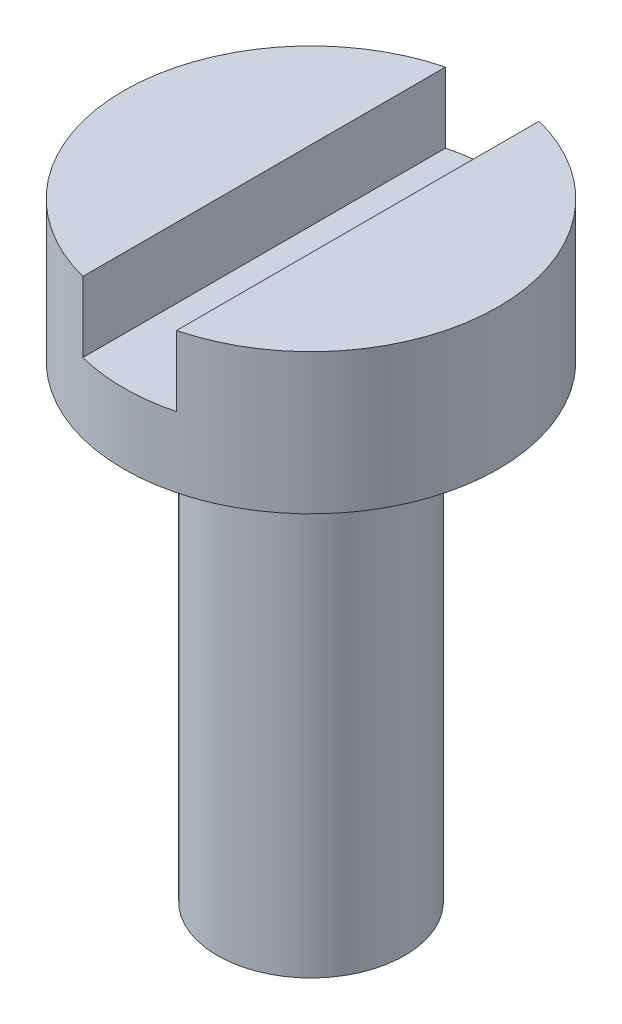
ISO-10303-21;
HEADER;
FILE_DESCRIPTION(('STEP AP214'),'2;1');
FILE_NAME('part.step','',(''),(''),'','','');
FILE_SCHEMA(('AUTOMOTIVE_DESIGN { 1 0 10303 214 1 1 1 1 }'));
ENDSEC;
DATA;
#1=APPLICATION_CONTEXT('core data for automotive mechanical design processes');
#2=APPLICATION_PROTOCOL_DEFINITION('international standard','automotive_design',2000,#1);
#3=PRODUCT_CONTEXT('',#1,'mechanical');
#4=PRODUCT('Part','Part','',(#3));
#5=PRODUCT_RELATED_PRODUCT_CATEGORY('part','',(#4));
#6=PRODUCT_DEFINITION_FORMATION('','',#4);
#7=PRODUCT_DEFINITION_CONTEXT('part definition',#1,'design');
#8=PRODUCT_DEFINITION('design','',#6,#7);
#9=PRODUCT_DEFINITION_SHAPE('','',#8);
#10=(LENGTH_UNIT() NAMED_UNIT(*) SI_UNIT(.MILLI.,.METRE.));
#11=(NAMED_UNIT(*) PLANE_ANGLE_UNIT() SI_UNIT($,.RADIAN.));
#12=(NAMED_UNIT(*) SI_UNIT($,.STERADIAN.) SOLID_ANGLE_UNIT());
#13=UNCERTAINTY_MEASURE_WITH_UNIT(LENGTH_MEASURE(1.E-05),#10,'distance_accuracy_value','');
#14=(GEOMETRIC_REPRESENTATION_CONTEXT(3) GLOBAL_UNCERTAINTY_ASSIGNED_CONTEXT((#13)) GLOBAL_UNIT_ASSIGNED_CONTEXT((#10,
#11,#12)) REPRESENTATION_CONTEXT('',''));
#15=CARTESIAN_POINT('',(0.,0.,0.));
#16=DIRECTION('',(0.,0.,1.));
#17=DIRECTION('',(1.,0.,0.));
#18=AXIS2_PLACEMENT_3D('',#15,#16,#17);
#19=CARTESIAN_POINT('',(0.,0.,0.));
#20=DIRECTION('',(0.,1.,0.));
#21=DIRECTION('',(0.,0.,1.));
#22=AXIS2_PLACEMENT_3D('',#19,#20,#21);
#23=PLANE('',#22);
#24=CARTESIAN_POINT('',(0.,0.,0.));
#25=DIRECTION('',(0.,1.,0.));
#26=DIRECTION('',(0.,0.,1.));
#27=AXIS2_PLACEMENT_3D('',#24,#25,#26);
#28=CIRCLE('',#27,4.);
#29=CARTESIAN_POINT('',(0.,0.,4.));
#30=VERTEX_POINT('',#29);
#31=EDGE_CURVE('E90',#30,#30,#28,.T.);
#32=ORIENTED_EDGE('',*,*,#31,.F.);
#33=EDGE_LOOP('',(#32));
#34=FACE_BOUND('',#33,.T.);
#35=CARTESIAN_POINT('',(0.,0.,0.));
#36=DIRECTION('',(0.,1.,0.));
#37=DIRECTION('',(0.,0.,1.));
#38=AXIS2_PLACEMENT_3D('',#35,#36,#37);
#39=CIRCLE('',#38,2.);
#40=CARTESIAN_POINT('',(0.,0.,2.));
#41=VERTEX_POINT('',#40);
#42=EDGE_CURVE('E11',#41,#41,#39,.F.);
#43=ORIENTED_EDGE('',*,*,#42,.F.);
#44=EDGE_LOOP('',(#43));
#45=FACE_BOUND('',#44,.T.);
#46=ADVANCED_FACE('F29',(#34,#45),#23,.F.);
#47=CARTESIAN_POINT('',(0.,3.,0.));
#48=DIRECTION('',(0.,1.,0.));
#49=DIRECTION('',(0.,0.,1.));
#50=AXIS2_PLACEMENT_3D('',#47,#48,#49);
#51=PLANE('',#50);
#52=DIRECTION('',(0.,0.,-1.));
#53=VECTOR('',#52,1.);
#54=CARTESIAN_POINT('',(1.,3.,0.));
#55=LINE('',#54,#53);
#56=CARTESIAN_POINT('',(1.,3.,3.87298334620742));
#57=VERTEX_POINT('',#56);
#58=CARTESIAN_POINT('',(1.,3.,-3.87298334620742));
#59=VERTEX_POINT('',#58);
#60=EDGE_CURVE('E77',#57,#59,#55,.T.);
#61=ORIENTED_EDGE('',*,*,#60,.F.);
#62=CARTESIAN_POINT('',(0.,3.,0.));
#63=DIRECTION('',(0.,1.,0.));
#64=DIRECTION('',(0.,0.,1.));
#65=AXIS2_PLACEMENT_3D('',#62,#63,#64);
#66=CIRCLE('',#65,4.);
#67=EDGE_CURVE('E78',#57,#59,#66,.T.);
#68=ORIENTED_EDGE('',*,*,#67,.T.);
#69=EDGE_LOOP('',(#61,#68));
#70=FACE_BOUND('',#69,.T.);
#71=ADVANCED_FACE('F110',(#70),#51,.T.);
#72=CARTESIAN_POINT('',(0.,3.,0.));
#73=DIRECTION('',(0.,-1.,0.));
#74=DIRECTION('',(0.,0.,-1.));
#75=AXIS2_PLACEMENT_3D('',#72,#73,#74);
#76=CYLINDRICAL_SURFACE('',#75,4.);
#77=CARTESIAN_POINT('',(0.,1.5,0.));
#78=DIRECTION('',(0.,1.,0.));
#79=DIRECTION('',(0.,0.,1.));
#80=AXIS2_PLACEMENT_3D('',#77,#78,#79);
#81=CIRCLE('',#80,4.);
#82=CARTESIAN_POINT('',(1.,1.5,-3.87298334620742));
#83=VERTEX_POINT('',#82);
#84=CARTESIAN_POINT('',(-1.,1.5,-3.87298334620742));
#85=VERTEX_POINT('',#84);
#86=EDGE_CURVE('E37',#83,#85,#81,.T.);
#87=ORIENTED_EDGE('',*,*,#86,.F.);
#88=DIRECTION('',(0.,-1.,0.));
#89=VECTOR('',#88,1.);
#90=CARTESIAN_POINT('',(1.,3.,-3.87298334620742));
#91=LINE('',#90,#89);
#92=EDGE_CURVE('E52',#83,#59,#91,.F.);
#93=ORIENTED_EDGE('',*,*,#92,.T.);
#94=ORIENTED_EDGE('',*,*,#67,.F.);
#95=DIRECTION('',(0.,-1.,0.));
#96=VECTOR('',#95,1.);
#97=CARTESIAN_POINT('',(1.,3.,3.87298334620742));
#98=LINE('',#97,#96);
#99=CARTESIAN_POINT('',(1.,1.5,3.87298334620742));
#100=VERTEX_POINT('',#99);
#101=EDGE_CURVE('E94',#57,#100,#98,.T.);
#102=ORIENTED_EDGE('',*,*,#101,.T.);
#103=CARTESIAN_POINT('',(-1.,1.5,3.87298334620742));
#104=VERTEX_POINT('',#103);
#105=EDGE_CURVE('E86',#104,#100,#81,.T.);
#106=ORIENTED_EDGE('',*,*,#105,.F.);
#107=DIRECTION('',(0.,-1.,0.));
#108=VECTOR('',#107,1.);
#109=CARTESIAN_POINT('',(-1.,3.,3.87298334620742));
#110=LINE('',#109,#108);
#111=CARTESIAN_POINT('',(-1.,3.,3.87298334620742));
#112=VERTEX_POINT('',#111);
#113=EDGE_CURVE('E72',#104,#112,#110,.F.);
#114=ORIENTED_EDGE('',*,*,#113,.T.);
#115=CARTESIAN_POINT('',(-1.,3.,-3.87298334620742));
#116=VERTEX_POINT('',#115);
#117=EDGE_CURVE('E84',#116,#112,#66,.T.);
#118=ORIENTED_EDGE('',*,*,#117,.F.);
#119=DIRECTION('',(0.,-1.,0.));
#120=VECTOR('',#119,1.);
#121=CARTESIAN_POINT('',(-1.,3.,-3.87298334620742));
#122=LINE('',#121,#120);
#123=EDGE_CURVE('E44',#116,#85,#122,.T.);
#124=ORIENTED_EDGE('',*,*,#123,.T.);
#125=EDGE_LOOP('',(#87,#93,#94,#102,#106,#114,#118,#124));
#126=FACE_BOUND('',#125,.T.);
#127=ORIENTED_EDGE('',*,*,#31,.T.);
#128=EDGE_LOOP('',(#127));
#129=FACE_BOUND('',#128,.T.);
#130=ADVANCED_FACE('F31',(#126,#129),#76,.T.);
#131=DIRECTION('',(0.,0.,1.));
#132=VECTOR('',#131,1.);
#133=CARTESIAN_POINT('',(-1.,3.,0.));
#134=LINE('',#133,#132);
#135=EDGE_CURVE('E69',#116,#112,#134,.T.);
#136=ORIENTED_EDGE('',*,*,#135,.F.);
#137=ORIENTED_EDGE('',*,*,#117,.T.);
#138=EDGE_LOOP('',(#136,#137));
#139=FACE_BOUND('',#138,.T.);
#140=ADVANCED_FACE('F89',(#139),#51,.T.);
#141=CARTESIAN_POINT('',(-1.,1.5,-5.0783360345759));
#142=DIRECTION('',(0.,1.,0.));
#143=DIRECTION('',(0.,0.,1.));
#144=AXIS2_PLACEMENT_3D('',#141,#142,#143);
#145=PLANE('',#144);
#146=ORIENTED_EDGE('',*,*,#86,.T.);
#147=DIRECTION('',(0.,0.,1.));
#148=VECTOR('',#147,1.);
#149=CARTESIAN_POINT('',(-1.,1.5,-5.0783360345759));
#150=LINE('',#149,#148);
#151=EDGE_CURVE('E100',#85,#104,#150,.T.);
#152=ORIENTED_EDGE('',*,*,#151,.T.);
#153=ORIENTED_EDGE('',*,*,#105,.T.);
#154=DIRECTION('',(0.,0.,-1.));
#155=VECTOR('',#154,1.);
#156=CARTESIAN_POINT('',(1.,1.5,4.40122456329912));
#157=LINE('',#156,#155);
#158=EDGE_CURVE('E87',#100,#83,#157,.T.);
#159=ORIENTED_EDGE('',*,*,#158,.T.);
#160=EDGE_LOOP('',(#146,#152,#153,#159));
#161=FACE_BOUND('',#160,.T.);
#162=ADVANCED_FACE('F99',(#161),#145,.T.);
#163=CARTESIAN_POINT('',(1.,1.5,4.40122456329912));
#164=DIRECTION('',(1.,0.,0.));
#165=DIRECTION('',(0.,0.,-1.));
#166=AXIS2_PLACEMENT_3D('',#163,#164,#165);
#167=PLANE('',#166);
#168=ORIENTED_EDGE('',*,*,#60,.T.);
#169=ORIENTED_EDGE('',*,*,#92,.F.);
#170=ORIENTED_EDGE('',*,*,#158,.F.);
#171=ORIENTED_EDGE('',*,*,#101,.F.);
#172=EDGE_LOOP('',(#168,#169,#170,#171));
#173=FACE_BOUND('',#172,.T.);
#174=ADVANCED_FACE('F108',(#173),#167,.F.);
#175=CARTESIAN_POINT('',(-1.,1.5,-5.0783360345759));
#176=DIRECTION('',(-1.,0.,0.));
#177=DIRECTION('',(0.,0.,1.));
#178=AXIS2_PLACEMENT_3D('',#175,#176,#177);
#179=PLANE('',#178);
#180=ORIENTED_EDGE('',*,*,#135,.T.);
#181=ORIENTED_EDGE('',*,*,#113,.F.);
#182=ORIENTED_EDGE('',*,*,#151,.F.);
#183=ORIENTED_EDGE('',*,*,#123,.F.);
#184=EDGE_LOOP('',(#180,#181,#182,#183));
#185=FACE_BOUND('',#184,.T.);
#186=ADVANCED_FACE('F71',(#185),#179,.F.);
#187=CARTESIAN_POINT('',(0.,-10.,0.));
#188=DIRECTION('',(0.,1.,0.));
#189=DIRECTION('',(0.,0.,1.));
#190=AXIS2_PLACEMENT_3D('',#187,#188,#189);
#191=CYLINDRICAL_SURFACE('',#190,2.);
#192=CARTESIAN_POINT('',(0.,-10.,0.));
#193=DIRECTION('',(0.,-1.,0.));
#194=DIRECTION('',(0.,0.,-1.));
#195=AXIS2_PLACEMENT_3D('',#192,#193,#194);
#196=CIRCLE('',#195,2.);
#197=CARTESIAN_POINT('',(0.,-10.,-2.));
#198=VERTEX_POINT('',#197);
#199=EDGE_CURVE('E101',#198,#198,#196,.T.);
#200=ORIENTED_EDGE('',*,*,#199,.F.);
#201=EDGE_LOOP('',(#200));
#202=FACE_BOUND('',#201,.T.);
#203=ORIENTED_EDGE('',*,*,#42,.T.);
#204=EDGE_LOOP('',(#203));
#205=FACE_BOUND('',#204,.T.);
#206=ADVANCED_FACE('F128',(#202,#205),#191,.T.);
#207=CARTESIAN_POINT('',(0.,-10.,0.));
#208=DIRECTION('',(0.,-1.,0.));
#209=DIRECTION('',(0.,0.,-1.));
#210=AXIS2_PLACEMENT_3D('',#207,#208,#209);
#211=PLANE('',#210);
#212=ORIENTED_EDGE('',*,*,#199,.T.);
#213=EDGE_LOOP('',(#212));
#214=FACE_BOUND('',#213,.T.);
#215=ADVANCED_FACE('F135',(#214),#211,.T.);
#216=CLOSED_SHELL('',(#46,#71,#130,#140,#162,#174,#186,#206,#215));
#217=MANIFOLD_SOLID_BREP('B2',#216);
#218=ADVANCED_BREP_SHAPE_REPRESENTATION('',(#18,#217),#14);
#219=SHAPE_DEFINITION_REPRESENTATION(#9,#218);
ENDSEC;
END-ISO-10303-21;
